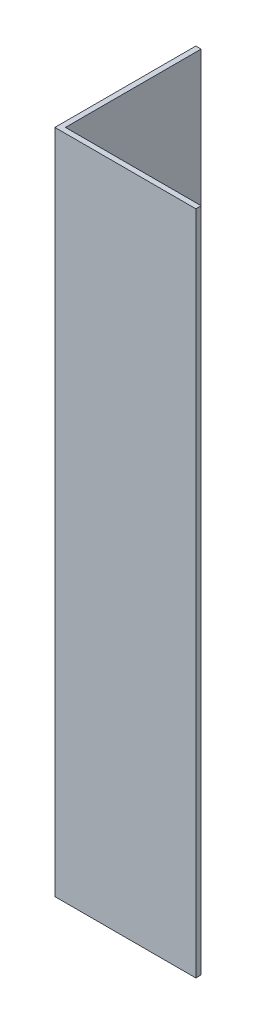
ISO-10303-21;
HEADER;
FILE_DESCRIPTION(('STEP AP214'),'2;1');
FILE_NAME('part.step','',(''),(''),'','','');
FILE_SCHEMA(('AUTOMOTIVE_DESIGN { 1 0 10303 214 1 1 1 1 }'));
ENDSEC;
DATA;
#1=APPLICATION_CONTEXT('core data for automotive mechanical design processes');
#2=APPLICATION_PROTOCOL_DEFINITION('international standard','automotive_design',2000,#1);
#3=PRODUCT_CONTEXT('',#1,'mechanical');
#4=PRODUCT('Part','Part','',(#3));
#5=PRODUCT_RELATED_PRODUCT_CATEGORY('part','',(#4));
#6=PRODUCT_DEFINITION_FORMATION('','',#4);
#7=PRODUCT_DEFINITION_CONTEXT('part definition',#1,'design');
#8=PRODUCT_DEFINITION('design','',#6,#7);
#9=PRODUCT_DEFINITION_SHAPE('','',#8);
#10=(LENGTH_UNIT() NAMED_UNIT(*) SI_UNIT(.MILLI.,.METRE.));
#11=(NAMED_UNIT(*) PLANE_ANGLE_UNIT() SI_UNIT($,.RADIAN.));
#12=(NAMED_UNIT(*) SI_UNIT($,.STERADIAN.) SOLID_ANGLE_UNIT());
#13=UNCERTAINTY_MEASURE_WITH_UNIT(LENGTH_MEASURE(1.E-05),#10,'distance_accuracy_value','');
#14=(GEOMETRIC_REPRESENTATION_CONTEXT(3) GLOBAL_UNCERTAINTY_ASSIGNED_CONTEXT((#13)) GLOBAL_UNIT_ASSIGNED_CONTEXT((#10,
#11,#12)) REPRESENTATION_CONTEXT('',''));
#15=CARTESIAN_POINT('',(0.,0.,0.));
#16=DIRECTION('',(0.,0.,1.));
#17=DIRECTION('',(1.,0.,0.));
#18=AXIS2_PLACEMENT_3D('',#15,#16,#17);
#19=CARTESIAN_POINT('',(20.,94.5,0.));
#20=DIRECTION('',(0.,0.,-1.));
#21=DIRECTION('',(-1.,0.,0.));
#22=AXIS2_PLACEMENT_3D('',#19,#20,#21);
#23=PLANE('',#22);
#24=DIRECTION('',(1.,0.,0.));
#25=VECTOR('',#24,1.);
#26=CARTESIAN_POINT('',(20.,0.,0.));
#27=LINE('',#26,#25);
#28=CARTESIAN_POINT('',(0.,0.,0.));
#29=VERTEX_POINT('',#28);
#30=CARTESIAN_POINT('',(20.,0.,0.));
#31=VERTEX_POINT('',#30);
#32=EDGE_CURVE('E119',#29,#31,#27,.T.);
#33=ORIENTED_EDGE('',*,*,#32,.T.);
#34=DIRECTION('',(0.,-1.,0.));
#35=VECTOR('',#34,1.);
#36=CARTESIAN_POINT('',(20.,94.5,0.));
#37=LINE('',#36,#35);
#38=CARTESIAN_POINT('',(20.,94.5,0.));
#39=VERTEX_POINT('',#38);
#40=EDGE_CURVE('E11',#39,#31,#37,.T.);
#41=ORIENTED_EDGE('',*,*,#40,.F.);
#42=DIRECTION('',(1.,0.,0.));
#43=VECTOR('',#42,1.);
#44=CARTESIAN_POINT('',(20.,94.5,0.));
#45=LINE('',#44,#43);
#46=CARTESIAN_POINT('',(0.,94.5,0.));
#47=VERTEX_POINT('',#46);
#48=EDGE_CURVE('E129',#47,#39,#45,.T.);
#49=ORIENTED_EDGE('',*,*,#48,.F.);
#50=DIRECTION('',(0.,-1.,0.));
#51=VECTOR('',#50,1.);
#52=CARTESIAN_POINT('',(0.,94.5,0.));
#53=LINE('',#52,#51);
#54=EDGE_CURVE('E115',#47,#29,#53,.T.);
#55=ORIENTED_EDGE('',*,*,#54,.T.);
#56=EDGE_LOOP('',(#33,#41,#49,#55));
#57=FACE_BOUND('',#56,.T.);
#58=ADVANCED_FACE('F35',(#57),#23,.F.);
#59=CARTESIAN_POINT('',(20.,94.5,-0.75));
#60=DIRECTION('',(-1.,0.,0.));
#61=DIRECTION('',(0.,0.,1.));
#62=AXIS2_PLACEMENT_3D('',#59,#60,#61);
#63=PLANE('',#62);
#64=DIRECTION('',(0.,0.,-1.));
#65=VECTOR('',#64,1.);
#66=CARTESIAN_POINT('',(20.,0.,-0.75));
#67=LINE('',#66,#65);
#68=CARTESIAN_POINT('',(20.,0.,-0.75));
#69=VERTEX_POINT('',#68);
#70=EDGE_CURVE('E122',#31,#69,#67,.T.);
#71=ORIENTED_EDGE('',*,*,#70,.T.);
#72=DIRECTION('',(0.,-1.,0.));
#73=VECTOR('',#72,1.);
#74=CARTESIAN_POINT('',(20.,94.5,-0.75));
#75=LINE('',#74,#73);
#76=CARTESIAN_POINT('',(20.,94.5,-0.75));
#77=VERTEX_POINT('',#76);
#78=EDGE_CURVE('E43',#77,#69,#75,.T.);
#79=ORIENTED_EDGE('',*,*,#78,.F.);
#80=DIRECTION('',(0.,0.,-1.));
#81=VECTOR('',#80,1.);
#82=CARTESIAN_POINT('',(20.,94.5,-0.75));
#83=LINE('',#82,#81);
#84=EDGE_CURVE('E88',#39,#77,#83,.T.);
#85=ORIENTED_EDGE('',*,*,#84,.F.);
#86=ORIENTED_EDGE('',*,*,#40,.T.);
#87=EDGE_LOOP('',(#71,#79,#85,#86));
#88=FACE_BOUND('',#87,.T.);
#89=ADVANCED_FACE('F153',(#88),#63,.F.);
#90=CARTESIAN_POINT('',(0.749999999999998,94.5,-0.749999999999998));
#91=DIRECTION('',(0.,0.,1.));
#92=DIRECTION('',(1.,0.,0.));
#93=AXIS2_PLACEMENT_3D('',#90,#91,#92);
#94=PLANE('',#93);
#95=DIRECTION('',(-1.,0.,0.));
#96=VECTOR('',#95,1.);
#97=CARTESIAN_POINT('',(0.749999999999998,0.,-0.749999999999998));
#98=LINE('',#97,#96);
#99=CARTESIAN_POINT('',(0.749999999999998,0.,-0.749999999999998));
#100=VERTEX_POINT('',#99);
#101=EDGE_CURVE('E124',#69,#100,#98,.T.);
#102=ORIENTED_EDGE('',*,*,#101,.T.);
#103=DIRECTION('',(0.,-1.,0.));
#104=VECTOR('',#103,1.);
#105=CARTESIAN_POINT('',(0.749999999999998,94.5,-0.749999999999998));
#106=LINE('',#105,#104);
#107=CARTESIAN_POINT('',(0.749999999999998,94.5,-0.749999999999998));
#108=VERTEX_POINT('',#107);
#109=EDGE_CURVE('E110',#108,#100,#106,.T.);
#110=ORIENTED_EDGE('',*,*,#109,.F.);
#111=DIRECTION('',(-1.,0.,0.));
#112=VECTOR('',#111,1.);
#113=CARTESIAN_POINT('',(0.749999999999998,94.5,-0.749999999999998));
#114=LINE('',#113,#112);
#115=EDGE_CURVE('E101',#77,#108,#114,.T.);
#116=ORIENTED_EDGE('',*,*,#115,.F.);
#117=ORIENTED_EDGE('',*,*,#78,.T.);
#118=EDGE_LOOP('',(#102,#110,#116,#117));
#119=FACE_BOUND('',#118,.T.);
#120=ADVANCED_FACE('F135',(#119),#94,.F.);
#121=CARTESIAN_POINT('',(0.749999999999998,94.5,-20.));
#122=DIRECTION('',(-1.,0.,0.));
#123=DIRECTION('',(0.,0.,1.));
#124=AXIS2_PLACEMENT_3D('',#121,#122,#123);
#125=PLANE('',#124);
#126=DIRECTION('',(0.,0.,-1.));
#127=VECTOR('',#126,1.);
#128=CARTESIAN_POINT('',(0.749999999999998,0.,-20.));
#129=LINE('',#128,#127);
#130=CARTESIAN_POINT('',(0.749999999999998,0.,-20.));
#131=VERTEX_POINT('',#130);
#132=EDGE_CURVE('E109',#100,#131,#129,.T.);
#133=ORIENTED_EDGE('',*,*,#132,.T.);
#134=DIRECTION('',(0.,-1.,0.));
#135=VECTOR('',#134,1.);
#136=CARTESIAN_POINT('',(0.749999999999998,94.5,-20.));
#137=LINE('',#136,#135);
#138=CARTESIAN_POINT('',(0.749999999999998,94.5,-20.));
#139=VERTEX_POINT('',#138);
#140=EDGE_CURVE('E106',#139,#131,#137,.T.);
#141=ORIENTED_EDGE('',*,*,#140,.F.);
#142=DIRECTION('',(0.,0.,-1.));
#143=VECTOR('',#142,1.);
#144=CARTESIAN_POINT('',(0.749999999999998,94.5,-20.));
#145=LINE('',#144,#143);
#146=EDGE_CURVE('E95',#108,#139,#145,.T.);
#147=ORIENTED_EDGE('',*,*,#146,.F.);
#148=ORIENTED_EDGE('',*,*,#109,.T.);
#149=EDGE_LOOP('',(#133,#141,#147,#148));
#150=FACE_BOUND('',#149,.T.);
#151=ADVANCED_FACE('F107',(#150),#125,.F.);
#152=CARTESIAN_POINT('',(0.,94.5,-20.));
#153=DIRECTION('',(0.,0.,1.));
#154=DIRECTION('',(1.,0.,0.));
#155=AXIS2_PLACEMENT_3D('',#152,#153,#154);
#156=PLANE('',#155);
#157=DIRECTION('',(-1.,0.,0.));
#158=VECTOR('',#157,1.);
#159=CARTESIAN_POINT('',(0.,0.,-20.));
#160=LINE('',#159,#158);
#161=CARTESIAN_POINT('',(0.,0.,-20.));
#162=VERTEX_POINT('',#161);
#163=EDGE_CURVE('E74',#131,#162,#160,.T.);
#164=ORIENTED_EDGE('',*,*,#163,.T.);
#165=DIRECTION('',(0.,-1.,0.));
#166=VECTOR('',#165,1.);
#167=CARTESIAN_POINT('',(0.,94.5,-20.));
#168=LINE('',#167,#166);
#169=CARTESIAN_POINT('',(0.,94.5,-20.));
#170=VERTEX_POINT('',#169);
#171=EDGE_CURVE('E111',#170,#162,#168,.T.);
#172=ORIENTED_EDGE('',*,*,#171,.F.);
#173=DIRECTION('',(-1.,0.,0.));
#174=VECTOR('',#173,1.);
#175=CARTESIAN_POINT('',(0.,94.5,-20.));
#176=LINE('',#175,#174);
#177=EDGE_CURVE('E99',#139,#170,#176,.T.);
#178=ORIENTED_EDGE('',*,*,#177,.F.);
#179=ORIENTED_EDGE('',*,*,#140,.T.);
#180=EDGE_LOOP('',(#164,#172,#178,#179));
#181=FACE_BOUND('',#180,.T.);
#182=ADVANCED_FACE('F113',(#181),#156,.F.);
#183=CARTESIAN_POINT('',(0.,94.5,0.));
#184=DIRECTION('',(1.,0.,0.));
#185=DIRECTION('',(0.,0.,-1.));
#186=AXIS2_PLACEMENT_3D('',#183,#184,#185);
#187=PLANE('',#186);
#188=DIRECTION('',(0.,0.,1.));
#189=VECTOR('',#188,1.);
#190=CARTESIAN_POINT('',(0.,0.,0.));
#191=LINE('',#190,#189);
#192=EDGE_CURVE('E80',#162,#29,#191,.T.);
#193=ORIENTED_EDGE('',*,*,#192,.T.);
#194=ORIENTED_EDGE('',*,*,#54,.F.);
#195=DIRECTION('',(0.,0.,1.));
#196=VECTOR('',#195,1.);
#197=CARTESIAN_POINT('',(0.,94.5,0.));
#198=LINE('',#197,#196);
#199=EDGE_CURVE('E51',#170,#47,#198,.T.);
#200=ORIENTED_EDGE('',*,*,#199,.F.);
#201=ORIENTED_EDGE('',*,*,#171,.T.);
#202=EDGE_LOOP('',(#193,#194,#200,#201));
#203=FACE_BOUND('',#202,.T.);
#204=ADVANCED_FACE('F142',(#203),#187,.F.);
#205=CARTESIAN_POINT('',(0.,94.5,0.));
#206=DIRECTION('',(0.,-1.,0.));
#207=DIRECTION('',(0.,0.,-1.));
#208=AXIS2_PLACEMENT_3D('',#205,#206,#207);
#209=PLANE('',#208);
#210=ORIENTED_EDGE('',*,*,#48,.T.);
#211=ORIENTED_EDGE('',*,*,#84,.T.);
#212=ORIENTED_EDGE('',*,*,#115,.T.);
#213=ORIENTED_EDGE('',*,*,#146,.T.);
#214=ORIENTED_EDGE('',*,*,#177,.T.);
#215=ORIENTED_EDGE('',*,*,#199,.T.);
#216=EDGE_LOOP('',(#210,#211,#212,#213,#214,#215));
#217=FACE_BOUND('',#216,.T.);
#218=ADVANCED_FACE('F97',(#217),#209,.F.);
#219=CARTESIAN_POINT('',(0.,0.,0.));
#220=DIRECTION('',(0.,-1.,0.));
#221=DIRECTION('',(0.,0.,-1.));
#222=AXIS2_PLACEMENT_3D('',#219,#220,#221);
#223=PLANE('',#222);
#224=ORIENTED_EDGE('',*,*,#32,.F.);
#225=ORIENTED_EDGE('',*,*,#192,.F.);
#226=ORIENTED_EDGE('',*,*,#163,.F.);
#227=ORIENTED_EDGE('',*,*,#132,.F.);
#228=ORIENTED_EDGE('',*,*,#101,.F.);
#229=ORIENTED_EDGE('',*,*,#70,.F.);
#230=EDGE_LOOP('',(#224,#225,#226,#227,#228,#229));
#231=FACE_BOUND('',#230,.T.);
#232=ADVANCED_FACE('F138',(#231),#223,.T.);
#233=CLOSED_SHELL('',(#58,#89,#120,#151,#182,#204,#218,#232));
#234=MANIFOLD_SOLID_BREP('B2',#233);
#235=ADVANCED_BREP_SHAPE_REPRESENTATION('',(#18,#234),#14);
#236=SHAPE_DEFINITION_REPRESENTATION(#9,#235);
ENDSEC;
END-ISO-10303-21;
